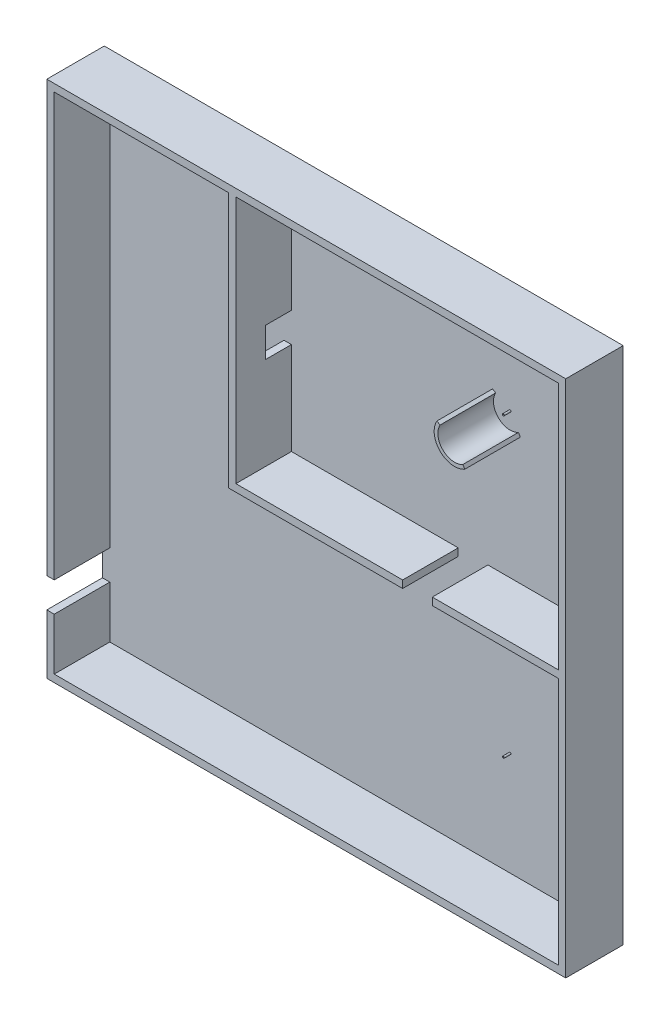
ISO-10303-21;
HEADER;
FILE_DESCRIPTION(('STEP AP214'),'2;1');
FILE_NAME('part.step','',(''),(''),'','','');
FILE_SCHEMA(('AUTOMOTIVE_DESIGN { 1 0 10303 214 1 1 1 1 }'));
ENDSEC;
DATA;
#1=APPLICATION_CONTEXT('core data for automotive mechanical design processes');
#2=APPLICATION_PROTOCOL_DEFINITION('international standard','automotive_design',2000,#1);
#3=PRODUCT_CONTEXT('',#1,'mechanical');
#4=PRODUCT('Part','Part','',(#3));
#5=PRODUCT_RELATED_PRODUCT_CATEGORY('part','',(#4));
#6=PRODUCT_DEFINITION_FORMATION('','',#4);
#7=PRODUCT_DEFINITION_CONTEXT('part definition',#1,'design');
#8=PRODUCT_DEFINITION('design','',#6,#7);
#9=PRODUCT_DEFINITION_SHAPE('','',#8);
#10=(LENGTH_UNIT() NAMED_UNIT(*) SI_UNIT(.MILLI.,.METRE.));
#11=(NAMED_UNIT(*) PLANE_ANGLE_UNIT() SI_UNIT($,.RADIAN.));
#12=(NAMED_UNIT(*) SI_UNIT($,.STERADIAN.) SOLID_ANGLE_UNIT());
#13=UNCERTAINTY_MEASURE_WITH_UNIT(LENGTH_MEASURE(1.E-05),#10,'distance_accuracy_value','');
#14=(GEOMETRIC_REPRESENTATION_CONTEXT(3) GLOBAL_UNCERTAINTY_ASSIGNED_CONTEXT((#13)) GLOBAL_UNIT_ASSIGNED_CONTEXT((#10,
#11,#12)) REPRESENTATION_CONTEXT('',''));
#15=CARTESIAN_POINT('',(0.,0.,0.));
#16=DIRECTION('',(0.,0.,1.));
#17=DIRECTION('',(1.,0.,0.));
#18=AXIS2_PLACEMENT_3D('',#15,#16,#17);
#19=CARTESIAN_POINT('',(4000.,4000.,1500.));
#20=DIRECTION('',(0.,0.,-1.));
#21=DIRECTION('',(-1.,0.,0.));
#22=AXIS2_PLACEMENT_3D('',#19,#20,#21);
#23=CYLINDRICAL_SURFACE('',#22,25.0000000000005);
#24=CARTESIAN_POINT('',(4000.,4000.,0.));
#25=DIRECTION('',(0.,0.,1.));
#26=DIRECTION('',(1.,0.,0.));
#27=AXIS2_PLACEMENT_3D('',#24,#25,#26);
#28=CIRCLE('',#27,25.0000000000005);
#29=CARTESIAN_POINT('',(4025.,4000.,0.));
#30=VERTEX_POINT('',#29);
#31=EDGE_CURVE('E552',#30,#30,#28,.T.);
#32=ORIENTED_EDGE('',*,*,#31,.T.);
#33=EDGE_LOOP('',(#32));
#34=FACE_BOUND('',#33,.T.);
#35=CARTESIAN_POINT('',(4000.,4000.,183.416876048224));
#36=DIRECTION('',(0.,0.,1.));
#37=DIRECTION('',(1.,0.,0.));
#38=AXIS2_PLACEMENT_3D('',#35,#36,#37);
#39=CIRCLE('',#38,25.0000000000005);
#40=CARTESIAN_POINT('',(4025.,4000.,183.416876048224));
#41=VERTEX_POINT('',#40);
#42=EDGE_CURVE('E498',#41,#41,#39,.T.);
#43=ORIENTED_EDGE('',*,*,#42,.F.);
#44=EDGE_LOOP('',(#43));
#45=FACE_BOUND('',#44,.T.);
#46=ADVANCED_FACE('F39',(#34,#45),#23,.T.);
#47=CARTESIAN_POINT('',(4000.,-4000.,1500.));
#48=DIRECTION('',(0.,0.,-1.));
#49=DIRECTION('',(-1.,0.,0.));
#50=AXIS2_PLACEMENT_3D('',#47,#48,#49);
#51=CYLINDRICAL_SURFACE('',#50,25.0000000000005);
#52=CARTESIAN_POINT('',(4000.,-4000.,0.));
#53=DIRECTION('',(0.,0.,1.));
#54=DIRECTION('',(1.,0.,0.));
#55=AXIS2_PLACEMENT_3D('',#52,#53,#54);
#56=CIRCLE('',#55,25.0000000000005);
#57=CARTESIAN_POINT('',(4025.,-4000.,0.));
#58=VERTEX_POINT('',#57);
#59=EDGE_CURVE('E556',#58,#58,#56,.T.);
#60=ORIENTED_EDGE('',*,*,#59,.T.);
#61=EDGE_LOOP('',(#60));
#62=FACE_BOUND('',#61,.T.);
#63=CARTESIAN_POINT('',(4000.,-4000.,183.416876048224));
#64=DIRECTION('',(0.,0.,1.));
#65=DIRECTION('',(1.,0.,0.));
#66=AXIS2_PLACEMENT_3D('',#63,#64,#65);
#67=CIRCLE('',#66,25.0000000000005);
#68=CARTESIAN_POINT('',(4025.,-4000.,183.416876048224));
#69=VERTEX_POINT('',#68);
#70=EDGE_CURVE('E497',#69,#69,#67,.T.);
#71=ORIENTED_EDGE('',*,*,#70,.F.);
#72=EDGE_LOOP('',(#71));
#73=FACE_BOUND('',#72,.T.);
#74=ADVANCED_FACE('F688',(#62,#73),#51,.T.);
#75=CARTESIAN_POINT('',(0.,0.,0.));
#76=DIRECTION('',(0.,0.,1.));
#77=DIRECTION('',(1.,0.,0.));
#78=AXIS2_PLACEMENT_3D('',#75,#76,#77);
#79=PLANE('',#78);
#80=ORIENTED_EDGE('',*,*,#31,.F.);
#81=EDGE_LOOP('',(#80));
#82=FACE_BOUND('',#81,.T.);
#83=ORIENTED_EDGE('',*,*,#59,.F.);
#84=EDGE_LOOP('',(#83));
#85=FACE_BOUND('',#84,.T.);
#86=DIRECTION('',(-1.,0.,0.));
#87=VECTOR('',#86,1.);
#88=CARTESIAN_POINT('',(-7000.,-5400.,0.));
#89=LINE('',#88,#87);
#90=CARTESIAN_POINT('',(-6800.,-5400.,0.));
#91=VERTEX_POINT('',#90);
#92=CARTESIAN_POINT('',(-7000.,-5400.,0.));
#93=VERTEX_POINT('',#92);
#94=EDGE_CURVE('E283',#91,#93,#89,.T.);
#95=ORIENTED_EDGE('',*,*,#94,.F.);
#96=DIRECTION('',(0.,1.,0.));
#97=VECTOR('',#96,1.);
#98=CARTESIAN_POINT('',(-6800.,-5400.,0.));
#99=LINE('',#98,#97);
#100=CARTESIAN_POINT('',(-6800.,-6800.,0.));
#101=VERTEX_POINT('',#100);
#102=EDGE_CURVE('E393',#101,#91,#99,.T.);
#103=ORIENTED_EDGE('',*,*,#102,.F.);
#104=DIRECTION('',(-1.,0.,0.));
#105=VECTOR('',#104,1.);
#106=CARTESIAN_POINT('',(-6800.,-6800.,0.));
#107=LINE('',#106,#105);
#108=CARTESIAN_POINT('',(6800.,-6800.,0.));
#109=VERTEX_POINT('',#108);
#110=EDGE_CURVE('E389',#109,#101,#107,.T.);
#111=ORIENTED_EDGE('',*,*,#110,.F.);
#112=DIRECTION('',(0.,-1.,0.));
#113=VECTOR('',#112,1.);
#114=CARTESIAN_POINT('',(6800.,-6800.,0.));
#115=LINE('',#114,#113);
#116=CARTESIAN_POINT('',(6800.,-99.9999999999992,0.));
#117=VERTEX_POINT('',#116);
#118=EDGE_CURVE('E385',#117,#109,#115,.T.);
#119=ORIENTED_EDGE('',*,*,#118,.F.);
#120=DIRECTION('',(1.,0.,0.));
#121=VECTOR('',#120,1.);
#122=CARTESIAN_POINT('',(6800.,-99.9999999999992,0.));
#123=LINE('',#122,#121);
#124=CARTESIAN_POINT('',(3400.,-99.9999999999996,0.));
#125=VERTEX_POINT('',#124);
#126=EDGE_CURVE('E381',#125,#117,#123,.T.);
#127=ORIENTED_EDGE('',*,*,#126,.F.);
#128=DIRECTION('',(0.,-1.,0.));
#129=VECTOR('',#128,1.);
#130=CARTESIAN_POINT('',(3400.,-99.9999999999996,0.));
#131=LINE('',#130,#129);
#132=CARTESIAN_POINT('',(3400.,100.,0.));
#133=VERTEX_POINT('',#132);
#134=EDGE_CURVE('E377',#133,#125,#131,.T.);
#135=ORIENTED_EDGE('',*,*,#134,.F.);
#136=DIRECTION('',(-1.,0.,0.));
#137=VECTOR('',#136,1.);
#138=CARTESIAN_POINT('',(3400.,100.,0.));
#139=LINE('',#138,#137);
#140=CARTESIAN_POINT('',(6800.,100.,0.));
#141=VERTEX_POINT('',#140);
#142=EDGE_CURVE('E373',#141,#133,#139,.T.);
#143=ORIENTED_EDGE('',*,*,#142,.F.);
#144=DIRECTION('',(0.,-1.,0.));
#145=VECTOR('',#144,1.);
#146=CARTESIAN_POINT('',(6800.,100.,0.));
#147=LINE('',#146,#145);
#148=CARTESIAN_POINT('',(6800.,6800.,0.));
#149=VERTEX_POINT('',#148);
#150=EDGE_CURVE('E369',#149,#141,#147,.T.);
#151=ORIENTED_EDGE('',*,*,#150,.F.);
#152=DIRECTION('',(1.,0.,0.));
#153=VECTOR('',#152,1.);
#154=CARTESIAN_POINT('',(6800.,6800.,0.));
#155=LINE('',#154,#153);
#156=CARTESIAN_POINT('',(-1900.,6800.,0.));
#157=VERTEX_POINT('',#156);
#158=EDGE_CURVE('E365',#157,#149,#155,.T.);
#159=ORIENTED_EDGE('',*,*,#158,.F.);
#160=DIRECTION('',(0.,1.,0.));
#161=VECTOR('',#160,1.);
#162=CARTESIAN_POINT('',(-1900.,6800.,0.));
#163=LINE('',#162,#161);
#164=CARTESIAN_POINT('',(-1900.,3400.,0.));
#165=VERTEX_POINT('',#164);
#166=EDGE_CURVE('E361',#165,#157,#163,.T.);
#167=ORIENTED_EDGE('',*,*,#166,.F.);
#168=DIRECTION('',(1.,0.,0.));
#169=VECTOR('',#168,1.);
#170=CARTESIAN_POINT('',(-1900.,3400.,0.));
#171=LINE('',#170,#169);
#172=CARTESIAN_POINT('',(-2100.,3400.,0.));
#173=VERTEX_POINT('',#172);
#174=EDGE_CURVE('E357',#173,#165,#171,.T.);
#175=ORIENTED_EDGE('',*,*,#174,.F.);
#176=DIRECTION('',(0.,-1.,0.));
#177=VECTOR('',#176,1.);
#178=CARTESIAN_POINT('',(-2100.,3400.,0.));
#179=LINE('',#178,#177);
#180=CARTESIAN_POINT('',(-2100.,6800.,0.));
#181=VERTEX_POINT('',#180);
#182=EDGE_CURVE('E353',#181,#173,#179,.T.);
#183=ORIENTED_EDGE('',*,*,#182,.F.);
#184=DIRECTION('',(1.,0.,0.));
#185=VECTOR('',#184,1.);
#186=CARTESIAN_POINT('',(-2100.,6800.,0.));
#187=LINE('',#186,#185);
#188=CARTESIAN_POINT('',(-6800.,6800.,0.));
#189=VERTEX_POINT('',#188);
#190=EDGE_CURVE('E349',#189,#181,#187,.T.);
#191=ORIENTED_EDGE('',*,*,#190,.F.);
#192=DIRECTION('',(0.,1.,0.));
#193=VECTOR('',#192,1.);
#194=CARTESIAN_POINT('',(-6800.,6800.,0.));
#195=LINE('',#194,#193);
#196=CARTESIAN_POINT('',(-6800.,-4600.,0.));
#197=VERTEX_POINT('',#196);
#198=EDGE_CURVE('E345',#197,#189,#195,.T.);
#199=ORIENTED_EDGE('',*,*,#198,.F.);
#200=DIRECTION('',(1.,0.,0.));
#201=VECTOR('',#200,1.);
#202=CARTESIAN_POINT('',(-6800.,-4600.,0.));
#203=LINE('',#202,#201);
#204=CARTESIAN_POINT('',(-7000.,-4600.,0.));
#205=VERTEX_POINT('',#204);
#206=EDGE_CURVE('E272',#205,#197,#203,.T.);
#207=ORIENTED_EDGE('',*,*,#206,.F.);
#208=DIRECTION('',(0.,-1.,0.));
#209=VECTOR('',#208,1.);
#210=CARTESIAN_POINT('',(-7000.,7000.,0.));
#211=LINE('',#210,#209);
#212=EDGE_CURVE('E461',#205,#93,#211,.T.);
#213=ORIENTED_EDGE('',*,*,#212,.T.);
#214=EDGE_LOOP('',(#95,#103,#111,#119,#127,#135,#143,#151,#159,#167,#175,#183,#191,#199,#207,#213));
#215=FACE_BOUND('',#214,.T.);
#216=DIRECTION('',(0.,1.,0.));
#217=VECTOR('',#216,1.);
#218=CARTESIAN_POINT('',(-1900.,2600.,0.));
#219=LINE('',#218,#217);
#220=CARTESIAN_POINT('',(-1900.,100.,0.));
#221=VERTEX_POINT('',#220);
#222=CARTESIAN_POINT('',(-1900.,2600.,0.));
#223=VERTEX_POINT('',#222);
#224=EDGE_CURVE('E265',#221,#223,#219,.T.);
#225=ORIENTED_EDGE('',*,*,#224,.F.);
#226=DIRECTION('',(-1.,0.,0.));
#227=VECTOR('',#226,1.);
#228=CARTESIAN_POINT('',(-1900.,100.,0.));
#229=LINE('',#228,#227);
#230=CARTESIAN_POINT('',(2600.,100.,0.));
#231=VERTEX_POINT('',#230);
#232=EDGE_CURVE('E560',#231,#221,#229,.T.);
#233=ORIENTED_EDGE('',*,*,#232,.F.);
#234=DIRECTION('',(0.,1.,0.));
#235=VECTOR('',#234,1.);
#236=CARTESIAN_POINT('',(2600.,100.,0.));
#237=LINE('',#236,#235);
#238=CARTESIAN_POINT('',(2600.,-99.9999999999996,0.));
#239=VERTEX_POINT('',#238);
#240=EDGE_CURVE('E566',#239,#231,#237,.T.);
#241=ORIENTED_EDGE('',*,*,#240,.F.);
#242=DIRECTION('',(1.,0.,0.));
#243=VECTOR('',#242,1.);
#244=CARTESIAN_POINT('',(2600.,-99.9999999999996,0.));
#245=LINE('',#244,#243);
#246=CARTESIAN_POINT('',(-2100.,-100.,0.));
#247=VERTEX_POINT('',#246);
#248=EDGE_CURVE('E584',#247,#239,#245,.T.);
#249=ORIENTED_EDGE('',*,*,#248,.F.);
#250=DIRECTION('',(0.,-1.,0.));
#251=VECTOR('',#250,1.);
#252=CARTESIAN_POINT('',(-2100.,-100.,0.));
#253=LINE('',#252,#251);
#254=CARTESIAN_POINT('',(-2100.,2600.,0.));
#255=VERTEX_POINT('',#254);
#256=EDGE_CURVE('E581',#255,#247,#253,.T.);
#257=ORIENTED_EDGE('',*,*,#256,.F.);
#258=DIRECTION('',(-1.,0.,0.));
#259=VECTOR('',#258,1.);
#260=CARTESIAN_POINT('',(-2100.,2600.,0.));
#261=LINE('',#260,#259);
#262=EDGE_CURVE('E578',#223,#255,#261,.T.);
#263=ORIENTED_EDGE('',*,*,#262,.F.);
#264=EDGE_LOOP('',(#225,#233,#241,#249,#257,#263));
#265=FACE_BOUND('',#264,.T.);
#266=DIRECTION('',(-0.49999999999999,0.866025403784444,0.));
#267=VECTOR('',#266,1.);
#268=CARTESIAN_POINT('',(4275.,3523.68602791856,0.));
#269=LINE('',#268,#267);
#270=CARTESIAN_POINT('',(4275.,3523.68602791856,0.));
#271=VERTEX_POINT('',#270);
#272=CARTESIAN_POINT('',(4225.,3610.288568297,0.));
#273=VERTEX_POINT('',#272);
#274=EDGE_CURVE('E532',#271,#273,#269,.T.);
#275=ORIENTED_EDGE('',*,*,#274,.F.);
#276=CARTESIAN_POINT('',(4000.,4000.,0.));
#277=DIRECTION('',(0.,0.,1.));
#278=DIRECTION('',(1.,0.,0.));
#279=AXIS2_PLACEMENT_3D('',#276,#277,#278);
#280=CIRCLE('',#279,550.);
#281=CARTESIAN_POINT('',(3523.68602791856,4275.,0.));
#282=VERTEX_POINT('',#281);
#283=EDGE_CURVE('E504',#282,#271,#280,.T.);
#284=ORIENTED_EDGE('',*,*,#283,.F.);
#285=DIRECTION('',(-0.86602540378444,0.499999999999997,0.));
#286=VECTOR('',#285,1.);
#287=CARTESIAN_POINT('',(3523.68602791856,4275.,0.));
#288=LINE('',#287,#286);
#289=CARTESIAN_POINT('',(3610.288568297,4225.,0.));
#290=VERTEX_POINT('',#289);
#291=EDGE_CURVE('E519',#290,#282,#288,.T.);
#292=ORIENTED_EDGE('',*,*,#291,.F.);
#293=CARTESIAN_POINT('',(4000.,4000.,0.));
#294=DIRECTION('',(0.,0.,-1.));
#295=DIRECTION('',(1.,0.,0.));
#296=AXIS2_PLACEMENT_3D('',#293,#294,#295);
#297=CIRCLE('',#296,450.);
#298=EDGE_CURVE('E535',#273,#290,#297,.T.);
#299=ORIENTED_EDGE('',*,*,#298,.F.);
#300=EDGE_LOOP('',(#275,#284,#292,#299));
#301=FACE_BOUND('',#300,.T.);
#302=ADVANCED_FACE('F605',(#82,#85,#215,#265,#301),#79,.T.);
#303=CARTESIAN_POINT('',(7000.,7000.,-50.));
#304=DIRECTION('',(1.,0.,0.));
#305=DIRECTION('',(0.,1.,0.));
#306=AXIS2_PLACEMENT_3D('',#303,#304,#305);
#307=PLANE('',#306);
#308=DIRECTION('',(0.,0.,1.));
#309=VECTOR('',#308,1.);
#310=CARTESIAN_POINT('',(7000.,7000.,-50.));
#311=LINE('',#310,#309);
#312=CARTESIAN_POINT('',(7000.,7000.,-50.));
#313=VERTEX_POINT('',#312);
#314=CARTESIAN_POINT('',(7000.,7000.,1500.));
#315=VERTEX_POINT('',#314);
#316=EDGE_CURVE('E478',#313,#315,#311,.T.);
#317=ORIENTED_EDGE('',*,*,#316,.T.);
#318=DIRECTION('',(0.,1.,0.));
#319=VECTOR('',#318,1.);
#320=CARTESIAN_POINT('',(7000.,7000.,1500.));
#321=LINE('',#320,#319);
#322=CARTESIAN_POINT('',(7000.,-7000.,1500.));
#323=VERTEX_POINT('',#322);
#324=EDGE_CURVE('E333',#323,#315,#321,.T.);
#325=ORIENTED_EDGE('',*,*,#324,.F.);
#326=DIRECTION('',(0.,0.,1.));
#327=VECTOR('',#326,1.);
#328=CARTESIAN_POINT('',(7000.,-7000.,-50.));
#329=LINE('',#328,#327);
#330=CARTESIAN_POINT('',(7000.,-7000.,-50.));
#331=VERTEX_POINT('',#330);
#332=EDGE_CURVE('E481',#331,#323,#329,.T.);
#333=ORIENTED_EDGE('',*,*,#332,.F.);
#334=DIRECTION('',(0.,1.,0.));
#335=VECTOR('',#334,1.);
#336=CARTESIAN_POINT('',(7000.,7000.,-50.));
#337=LINE('',#336,#335);
#338=EDGE_CURVE('E462',#331,#313,#337,.T.);
#339=ORIENTED_EDGE('',*,*,#338,.T.);
#340=EDGE_LOOP('',(#317,#325,#333,#339));
#341=FACE_BOUND('',#340,.T.);
#342=ADVANCED_FACE('F41',(#341),#307,.T.);
#343=CARTESIAN_POINT('',(-7000.,-7000.,-50.));
#344=DIRECTION('',(0.,-1.,0.));
#345=DIRECTION('',(0.,0.,-1.));
#346=AXIS2_PLACEMENT_3D('',#343,#344,#345);
#347=PLANE('',#346);
#348=ORIENTED_EDGE('',*,*,#332,.T.);
#349=DIRECTION('',(1.,0.,0.));
#350=VECTOR('',#349,1.);
#351=CARTESIAN_POINT('',(7000.,-7000.,1500.));
#352=LINE('',#351,#350);
#353=CARTESIAN_POINT('',(-7000.,-7000.,1500.));
#354=VERTEX_POINT('',#353);
#355=EDGE_CURVE('E329',#354,#323,#352,.T.);
#356=ORIENTED_EDGE('',*,*,#355,.F.);
#357=DIRECTION('',(0.,0.,1.));
#358=VECTOR('',#357,1.);
#359=CARTESIAN_POINT('',(-7000.,-7000.,-50.));
#360=LINE('',#359,#358);
#361=CARTESIAN_POINT('',(-7000.,-7000.,-50.));
#362=VERTEX_POINT('',#361);
#363=EDGE_CURVE('E484',#362,#354,#360,.T.);
#364=ORIENTED_EDGE('',*,*,#363,.F.);
#365=DIRECTION('',(1.,0.,0.));
#366=VECTOR('',#365,1.);
#367=CARTESIAN_POINT('',(-7000.,-7000.,-50.));
#368=LINE('',#367,#366);
#369=EDGE_CURVE('E474',#362,#331,#368,.T.);
#370=ORIENTED_EDGE('',*,*,#369,.T.);
#371=EDGE_LOOP('',(#348,#356,#364,#370));
#372=FACE_BOUND('',#371,.T.);
#373=ADVANCED_FACE('F979',(#372),#347,.T.);
#374=CARTESIAN_POINT('',(-7000.,7000.,-50.));
#375=DIRECTION('',(-1.,0.,0.));
#376=DIRECTION('',(0.,-1.,0.));
#377=AXIS2_PLACEMENT_3D('',#374,#375,#376);
#378=PLANE('',#377);
#379=ORIENTED_EDGE('',*,*,#212,.F.);
#380=DIRECTION('',(0.,0.,-1.));
#381=VECTOR('',#380,1.);
#382=CARTESIAN_POINT('',(-7000.,-4600.,1500.));
#383=LINE('',#382,#381);
#384=CARTESIAN_POINT('',(-7000.,-4600.,1500.));
#385=VERTEX_POINT('',#384);
#386=EDGE_CURVE('E457',#385,#205,#383,.T.);
#387=ORIENTED_EDGE('',*,*,#386,.F.);
#388=DIRECTION('',(0.,-1.,0.));
#389=VECTOR('',#388,1.);
#390=CARTESIAN_POINT('',(-7000.,-4600.,1500.));
#391=LINE('',#390,#389);
#392=CARTESIAN_POINT('',(-7000.,7000.,1500.));
#393=VERTEX_POINT('',#392);
#394=EDGE_CURVE('E278',#393,#385,#391,.T.);
#395=ORIENTED_EDGE('',*,*,#394,.F.);
#396=DIRECTION('',(0.,0.,1.));
#397=VECTOR('',#396,1.);
#398=CARTESIAN_POINT('',(-7000.,7000.,-50.));
#399=LINE('',#398,#397);
#400=CARTESIAN_POINT('',(-7000.,7000.,-50.));
#401=VERTEX_POINT('',#400);
#402=EDGE_CURVE('E487',#401,#393,#399,.T.);
#403=ORIENTED_EDGE('',*,*,#402,.F.);
#404=DIRECTION('',(0.,-1.,0.));
#405=VECTOR('',#404,1.);
#406=CARTESIAN_POINT('',(-7000.,7000.,-50.));
#407=LINE('',#406,#405);
#408=EDGE_CURVE('E470',#401,#362,#407,.T.);
#409=ORIENTED_EDGE('',*,*,#408,.T.);
#410=ORIENTED_EDGE('',*,*,#363,.T.);
#411=DIRECTION('',(0.,-1.,0.));
#412=VECTOR('',#411,1.);
#413=CARTESIAN_POINT('',(-7000.,-7000.,1500.));
#414=LINE('',#413,#412);
#415=CARTESIAN_POINT('',(-7000.,-5400.,1500.));
#416=VERTEX_POINT('',#415);
#417=EDGE_CURVE('E325',#416,#354,#414,.T.);
#418=ORIENTED_EDGE('',*,*,#417,.F.);
#419=DIRECTION('',(0.,0.,-1.));
#420=VECTOR('',#419,1.);
#421=CARTESIAN_POINT('',(-7000.,-5400.,1500.));
#422=LINE('',#421,#420);
#423=EDGE_CURVE('E341',#416,#93,#422,.T.);
#424=ORIENTED_EDGE('',*,*,#423,.T.);
#425=EDGE_LOOP('',(#379,#387,#395,#403,#409,#410,#418,#424));
#426=FACE_BOUND('',#425,.T.);
#427=ADVANCED_FACE('F634',(#426),#378,.T.);
#428=CARTESIAN_POINT('',(-7000.,7000.,-50.));
#429=DIRECTION('',(0.,1.,0.));
#430=DIRECTION('',(0.,0.,1.));
#431=AXIS2_PLACEMENT_3D('',#428,#429,#430);
#432=PLANE('',#431);
#433=ORIENTED_EDGE('',*,*,#402,.T.);
#434=DIRECTION('',(-1.,0.,0.));
#435=VECTOR('',#434,1.);
#436=CARTESIAN_POINT('',(-7000.,7000.,1500.));
#437=LINE('',#436,#435);
#438=EDGE_CURVE('E337',#315,#393,#437,.T.);
#439=ORIENTED_EDGE('',*,*,#438,.F.);
#440=ORIENTED_EDGE('',*,*,#316,.F.);
#441=DIRECTION('',(-1.,0.,0.));
#442=VECTOR('',#441,1.);
#443=CARTESIAN_POINT('',(-7000.,7000.,-50.));
#444=LINE('',#443,#442);
#445=EDGE_CURVE('E466',#313,#401,#444,.T.);
#446=ORIENTED_EDGE('',*,*,#445,.T.);
#447=EDGE_LOOP('',(#433,#439,#440,#446));
#448=FACE_BOUND('',#447,.T.);
#449=ADVANCED_FACE('F993',(#448),#432,.T.);
#450=CARTESIAN_POINT('',(0.,0.,-50.));
#451=DIRECTION('',(0.,0.,1.));
#452=DIRECTION('',(1.,0.,0.));
#453=AXIS2_PLACEMENT_3D('',#450,#451,#452);
#454=PLANE('',#453);
#455=ORIENTED_EDGE('',*,*,#338,.F.);
#456=ORIENTED_EDGE('',*,*,#369,.F.);
#457=ORIENTED_EDGE('',*,*,#408,.F.);
#458=ORIENTED_EDGE('',*,*,#445,.F.);
#459=EDGE_LOOP('',(#455,#456,#457,#458));
#460=FACE_BOUND('',#459,.T.);
#461=ADVANCED_FACE('F1000',(#460),#454,.F.);
#462=CARTESIAN_POINT('',(-6800.,-4600.,1500.));
#463=DIRECTION('',(0.,1.,0.));
#464=DIRECTION('',(-1.,0.,0.));
#465=AXIS2_PLACEMENT_3D('',#462,#463,#464);
#466=PLANE('',#465);
#467=ORIENTED_EDGE('',*,*,#206,.T.);
#468=DIRECTION('',(0.,0.,-1.));
#469=VECTOR('',#468,1.);
#470=CARTESIAN_POINT('',(-6800.,-4600.,1500.));
#471=LINE('',#470,#469);
#472=CARTESIAN_POINT('',(-6800.,-4600.,1500.));
#473=VERTEX_POINT('',#472);
#474=EDGE_CURVE('E453',#473,#197,#471,.T.);
#475=ORIENTED_EDGE('',*,*,#474,.F.);
#476=DIRECTION('',(1.,0.,0.));
#477=VECTOR('',#476,1.);
#478=CARTESIAN_POINT('',(-6800.,-4600.,1500.));
#479=LINE('',#478,#477);
#480=EDGE_CURVE('E282',#385,#473,#479,.T.);
#481=ORIENTED_EDGE('',*,*,#480,.F.);
#482=ORIENTED_EDGE('',*,*,#386,.T.);
#483=EDGE_LOOP('',(#467,#475,#481,#482));
#484=FACE_BOUND('',#483,.T.);
#485=ADVANCED_FACE('F630',(#484),#466,.F.);
#486=CARTESIAN_POINT('',(-6800.,6800.,1500.));
#487=DIRECTION('',(-1.,0.,0.));
#488=DIRECTION('',(0.,-1.,0.));
#489=AXIS2_PLACEMENT_3D('',#486,#487,#488);
#490=PLANE('',#489);
#491=ORIENTED_EDGE('',*,*,#198,.T.);
#492=DIRECTION('',(0.,0.,-1.));
#493=VECTOR('',#492,1.);
#494=CARTESIAN_POINT('',(-6800.,6800.,1500.));
#495=LINE('',#494,#493);
#496=CARTESIAN_POINT('',(-6800.,6800.,1500.));
#497=VERTEX_POINT('',#496);
#498=EDGE_CURVE('E449',#497,#189,#495,.T.);
#499=ORIENTED_EDGE('',*,*,#498,.F.);
#500=DIRECTION('',(0.,1.,0.));
#501=VECTOR('',#500,1.);
#502=CARTESIAN_POINT('',(-6800.,6800.,1500.));
#503=LINE('',#502,#501);
#504=EDGE_CURVE('E286',#473,#497,#503,.T.);
#505=ORIENTED_EDGE('',*,*,#504,.F.);
#506=ORIENTED_EDGE('',*,*,#474,.T.);
#507=EDGE_LOOP('',(#491,#499,#505,#506));
#508=FACE_BOUND('',#507,.T.);
#509=ADVANCED_FACE('F626',(#508),#490,.F.);
#510=CARTESIAN_POINT('',(-2100.,6800.,1500.));
#511=DIRECTION('',(0.,1.,0.));
#512=DIRECTION('',(-1.,0.,0.));
#513=AXIS2_PLACEMENT_3D('',#510,#511,#512);
#514=PLANE('',#513);
#515=ORIENTED_EDGE('',*,*,#190,.T.);
#516=DIRECTION('',(0.,0.,-1.));
#517=VECTOR('',#516,1.);
#518=CARTESIAN_POINT('',(-2100.,6800.,1500.));
#519=LINE('',#518,#517);
#520=CARTESIAN_POINT('',(-2100.,6800.,1500.));
#521=VERTEX_POINT('',#520);
#522=EDGE_CURVE('E445',#521,#181,#519,.T.);
#523=ORIENTED_EDGE('',*,*,#522,.F.);
#524=DIRECTION('',(1.,0.,0.));
#525=VECTOR('',#524,1.);
#526=CARTESIAN_POINT('',(-2100.,6800.,1500.));
#527=LINE('',#526,#525);
#528=EDGE_CURVE('E289',#497,#521,#527,.T.);
#529=ORIENTED_EDGE('',*,*,#528,.F.);
#530=ORIENTED_EDGE('',*,*,#498,.T.);
#531=EDGE_LOOP('',(#515,#523,#529,#530));
#532=FACE_BOUND('',#531,.T.);
#533=ADVANCED_FACE('F621',(#532),#514,.F.);
#534=CARTESIAN_POINT('',(-2100.,3400.,1500.));
#535=DIRECTION('',(1.,0.,0.));
#536=DIRECTION('',(0.,0.,-1.));
#537=AXIS2_PLACEMENT_3D('',#534,#535,#536);
#538=PLANE('',#537);
#539=DIRECTION('',(0.,0.,-1.));
#540=VECTOR('',#539,1.);
#541=CARTESIAN_POINT('',(-2100.,-100.,1500.));
#542=LINE('',#541,#540);
#543=CARTESIAN_POINT('',(-2100.,-100.,1500.));
#544=VERTEX_POINT('',#543);
#545=EDGE_CURVE('E274',#544,#247,#542,.T.);
#546=ORIENTED_EDGE('',*,*,#545,.F.);
#547=DIRECTION('',(0.,-1.,0.));
#548=VECTOR('',#547,1.);
#549=CARTESIAN_POINT('',(-2100.,3400.,1500.));
#550=LINE('',#549,#548);
#551=EDGE_CURVE('E292',#521,#544,#550,.T.);
#552=ORIENTED_EDGE('',*,*,#551,.F.);
#553=ORIENTED_EDGE('',*,*,#522,.T.);
#554=ORIENTED_EDGE('',*,*,#182,.T.);
#555=DIRECTION('',(0.,0.,-1.));
#556=VECTOR('',#555,1.);
#557=CARTESIAN_POINT('',(-2100.,3400.,1500.));
#558=LINE('',#557,#556);
#559=CARTESIAN_POINT('',(-2100.,3400.,700.));
#560=VERTEX_POINT('',#559);
#561=EDGE_CURVE('E442',#560,#173,#558,.T.);
#562=ORIENTED_EDGE('',*,*,#561,.F.);
#563=DIRECTION('',(0.,-1.,0.));
#564=VECTOR('',#563,1.);
#565=CARTESIAN_POINT('',(-2100.,2152.28992603385,700.));
#566=LINE('',#565,#564);
#567=CARTESIAN_POINT('',(-2100.,2600.,700.));
#568=VERTEX_POINT('',#567);
#569=EDGE_CURVE('E251',#560,#568,#566,.T.);
#570=ORIENTED_EDGE('',*,*,#569,.T.);
#571=DIRECTION('',(0.,0.,-1.));
#572=VECTOR('',#571,1.);
#573=CARTESIAN_POINT('',(-2100.,2600.,1500.));
#574=LINE('',#573,#572);
#575=EDGE_CURVE('E259',#568,#255,#574,.T.);
#576=ORIENTED_EDGE('',*,*,#575,.T.);
#577=ORIENTED_EDGE('',*,*,#256,.T.);
#578=EDGE_LOOP('',(#546,#552,#553,#554,#562,#570,#576,#577));
#579=FACE_BOUND('',#578,.T.);
#580=ADVANCED_FACE('F618',(#579),#538,.F.);
#581=CARTESIAN_POINT('',(-1900.,3400.,1500.));
#582=DIRECTION('',(0.,1.,0.));
#583=DIRECTION('',(0.,0.,1.));
#584=AXIS2_PLACEMENT_3D('',#581,#582,#583);
#585=PLANE('',#584);
#586=DIRECTION('',(0.,0.,-1.));
#587=VECTOR('',#586,1.);
#588=CARTESIAN_POINT('',(-1900.,3400.,1500.));
#589=LINE('',#588,#587);
#590=CARTESIAN_POINT('',(-1900.,3400.,700.));
#591=VERTEX_POINT('',#590);
#592=EDGE_CURVE('E439',#591,#165,#589,.T.);
#593=ORIENTED_EDGE('',*,*,#592,.F.);
#594=DIRECTION('',(-1.,0.,0.));
#595=VECTOR('',#594,1.);
#596=CARTESIAN_POINT('',(-1900.,3400.,700.));
#597=LINE('',#596,#595);
#598=EDGE_CURVE('E246',#591,#560,#597,.T.);
#599=ORIENTED_EDGE('',*,*,#598,.T.);
#600=ORIENTED_EDGE('',*,*,#561,.T.);
#601=ORIENTED_EDGE('',*,*,#174,.T.);
#602=EDGE_LOOP('',(#593,#599,#600,#601));
#603=FACE_BOUND('',#602,.T.);
#604=ADVANCED_FACE('F675',(#603),#585,.F.);
#605=CARTESIAN_POINT('',(-1900.,6800.,1500.));
#606=DIRECTION('',(-1.,0.,0.));
#607=DIRECTION('',(0.,-1.,0.));
#608=AXIS2_PLACEMENT_3D('',#605,#606,#607);
#609=PLANE('',#608);
#610=DIRECTION('',(0.,0.,-1.));
#611=VECTOR('',#610,1.);
#612=CARTESIAN_POINT('',(-1900.,6800.,1500.));
#613=LINE('',#612,#611);
#614=CARTESIAN_POINT('',(-1900.,6800.,1500.));
#615=VERTEX_POINT('',#614);
#616=EDGE_CURVE('E435',#615,#157,#613,.T.);
#617=ORIENTED_EDGE('',*,*,#616,.F.);
#618=DIRECTION('',(0.,1.,0.));
#619=VECTOR('',#618,1.);
#620=CARTESIAN_POINT('',(-1900.,6800.,1500.));
#621=LINE('',#620,#619);
#622=CARTESIAN_POINT('',(-1900.,100.,1500.));
#623=VERTEX_POINT('',#622);
#624=EDGE_CURVE('E295',#623,#615,#621,.T.);
#625=ORIENTED_EDGE('',*,*,#624,.F.);
#626=DIRECTION('',(0.,0.,-1.));
#627=VECTOR('',#626,1.);
#628=CARTESIAN_POINT('',(-1900.,100.,1500.));
#629=LINE('',#628,#627);
#630=EDGE_CURVE('E268',#623,#221,#629,.T.);
#631=ORIENTED_EDGE('',*,*,#630,.T.);
#632=ORIENTED_EDGE('',*,*,#224,.T.);
#633=DIRECTION('',(0.,0.,-1.));
#634=VECTOR('',#633,1.);
#635=CARTESIAN_POINT('',(-1900.,2600.,1500.));
#636=LINE('',#635,#634);
#637=CARTESIAN_POINT('',(-1900.,2600.,700.));
#638=VERTEX_POINT('',#637);
#639=EDGE_CURVE('E257',#638,#223,#636,.T.);
#640=ORIENTED_EDGE('',*,*,#639,.F.);
#641=DIRECTION('',(0.,1.,0.));
#642=VECTOR('',#641,1.);
#643=CARTESIAN_POINT('',(-1900.,3671.9436957082,700.));
#644=LINE('',#643,#642);
#645=EDGE_CURVE('E240',#638,#591,#644,.T.);
#646=ORIENTED_EDGE('',*,*,#645,.T.);
#647=ORIENTED_EDGE('',*,*,#592,.T.);
#648=ORIENTED_EDGE('',*,*,#166,.T.);
#649=EDGE_LOOP('',(#617,#625,#631,#632,#640,#646,#647,#648));
#650=FACE_BOUND('',#649,.T.);
#651=ADVANCED_FACE('F263',(#650),#609,.F.);
#652=CARTESIAN_POINT('',(6800.,6800.,1500.));
#653=DIRECTION('',(0.,1.,0.));
#654=DIRECTION('',(-1.,0.,0.));
#655=AXIS2_PLACEMENT_3D('',#652,#653,#654);
#656=PLANE('',#655);
#657=ORIENTED_EDGE('',*,*,#158,.T.);
#658=DIRECTION('',(0.,0.,-1.));
#659=VECTOR('',#658,1.);
#660=CARTESIAN_POINT('',(6800.,6800.,1500.));
#661=LINE('',#660,#659);
#662=CARTESIAN_POINT('',(6800.,6800.,1500.));
#663=VERTEX_POINT('',#662);
#664=EDGE_CURVE('E431',#663,#149,#661,.T.);
#665=ORIENTED_EDGE('',*,*,#664,.F.);
#666=DIRECTION('',(1.,0.,0.));
#667=VECTOR('',#666,1.);
#668=CARTESIAN_POINT('',(6800.,6800.,1500.));
#669=LINE('',#668,#667);
#670=EDGE_CURVE('E298',#615,#663,#669,.T.);
#671=ORIENTED_EDGE('',*,*,#670,.F.);
#672=ORIENTED_EDGE('',*,*,#616,.T.);
#673=EDGE_LOOP('',(#657,#665,#671,#672));
#674=FACE_BOUND('',#673,.T.);
#675=ADVANCED_FACE('F672',(#674),#656,.F.);
#676=CARTESIAN_POINT('',(6800.,100.,1500.));
#677=DIRECTION('',(1.,0.,0.));
#678=DIRECTION('',(0.,0.,-1.));
#679=AXIS2_PLACEMENT_3D('',#676,#677,#678);
#680=PLANE('',#679);
#681=ORIENTED_EDGE('',*,*,#150,.T.);
#682=DIRECTION('',(0.,0.,-1.));
#683=VECTOR('',#682,1.);
#684=CARTESIAN_POINT('',(6800.,100.,1500.));
#685=LINE('',#684,#683);
#686=CARTESIAN_POINT('',(6800.,100.,1500.));
#687=VERTEX_POINT('',#686);
#688=EDGE_CURVE('E427',#687,#141,#685,.T.);
#689=ORIENTED_EDGE('',*,*,#688,.F.);
#690=DIRECTION('',(0.,-1.,0.));
#691=VECTOR('',#690,1.);
#692=CARTESIAN_POINT('',(6800.,100.,1500.));
#693=LINE('',#692,#691);
#694=EDGE_CURVE('E301',#663,#687,#693,.T.);
#695=ORIENTED_EDGE('',*,*,#694,.F.);
#696=ORIENTED_EDGE('',*,*,#664,.T.);
#697=EDGE_LOOP('',(#681,#689,#695,#696));
#698=FACE_BOUND('',#697,.T.);
#699=ADVANCED_FACE('F667',(#698),#680,.F.);
#700=CARTESIAN_POINT('',(3400.,100.,1500.));
#701=DIRECTION('',(0.,-1.,0.));
#702=DIRECTION('',(0.,0.,-1.));
#703=AXIS2_PLACEMENT_3D('',#700,#701,#702);
#704=PLANE('',#703);
#705=ORIENTED_EDGE('',*,*,#142,.T.);
#706=DIRECTION('',(0.,0.,-1.));
#707=VECTOR('',#706,1.);
#708=CARTESIAN_POINT('',(3400.,100.,1500.));
#709=LINE('',#708,#707);
#710=CARTESIAN_POINT('',(3400.,100.,1500.));
#711=VERTEX_POINT('',#710);
#712=EDGE_CURVE('E423',#711,#133,#709,.T.);
#713=ORIENTED_EDGE('',*,*,#712,.F.);
#714=DIRECTION('',(-1.,0.,0.));
#715=VECTOR('',#714,1.);
#716=CARTESIAN_POINT('',(3400.,100.,1500.));
#717=LINE('',#716,#715);
#718=EDGE_CURVE('E304',#687,#711,#717,.T.);
#719=ORIENTED_EDGE('',*,*,#718,.F.);
#720=ORIENTED_EDGE('',*,*,#688,.T.);
#721=EDGE_LOOP('',(#705,#713,#719,#720));
#722=FACE_BOUND('',#721,.T.);
#723=ADVANCED_FACE('F664',(#722),#704,.F.);
#724=CARTESIAN_POINT('',(3400.,-99.9999999999996,1500.));
#725=DIRECTION('',(1.,0.,0.));
#726=DIRECTION('',(0.,0.,-1.));
#727=AXIS2_PLACEMENT_3D('',#724,#725,#726);
#728=PLANE('',#727);
#729=ORIENTED_EDGE('',*,*,#134,.T.);
#730=DIRECTION('',(0.,0.,-1.));
#731=VECTOR('',#730,1.);
#732=CARTESIAN_POINT('',(3400.,-99.9999999999996,1500.));
#733=LINE('',#732,#731);
#734=CARTESIAN_POINT('',(3400.,-99.9999999999996,1500.));
#735=VERTEX_POINT('',#734);
#736=EDGE_CURVE('E419',#735,#125,#733,.T.);
#737=ORIENTED_EDGE('',*,*,#736,.F.);
#738=DIRECTION('',(0.,-1.,0.));
#739=VECTOR('',#738,1.);
#740=CARTESIAN_POINT('',(3400.,-99.9999999999996,1500.));
#741=LINE('',#740,#739);
#742=EDGE_CURVE('E307',#711,#735,#741,.T.);
#743=ORIENTED_EDGE('',*,*,#742,.F.);
#744=ORIENTED_EDGE('',*,*,#712,.T.);
#745=EDGE_LOOP('',(#729,#737,#743,#744));
#746=FACE_BOUND('',#745,.T.);
#747=ADVANCED_FACE('F659',(#746),#728,.F.);
#748=CARTESIAN_POINT('',(6800.,-99.9999999999992,1500.));
#749=DIRECTION('',(0.,1.,0.));
#750=DIRECTION('',(-1.,0.,0.));
#751=AXIS2_PLACEMENT_3D('',#748,#749,#750);
#752=PLANE('',#751);
#753=ORIENTED_EDGE('',*,*,#126,.T.);
#754=DIRECTION('',(0.,0.,-1.));
#755=VECTOR('',#754,1.);
#756=CARTESIAN_POINT('',(6800.,-99.9999999999992,1500.));
#757=LINE('',#756,#755);
#758=CARTESIAN_POINT('',(6800.,-99.9999999999992,1500.));
#759=VERTEX_POINT('',#758);
#760=EDGE_CURVE('E415',#759,#117,#757,.T.);
#761=ORIENTED_EDGE('',*,*,#760,.F.);
#762=DIRECTION('',(1.,0.,0.));
#763=VECTOR('',#762,1.);
#764=CARTESIAN_POINT('',(6800.,-99.9999999999992,1500.));
#765=LINE('',#764,#763);
#766=EDGE_CURVE('E310',#735,#759,#765,.T.);
#767=ORIENTED_EDGE('',*,*,#766,.F.);
#768=ORIENTED_EDGE('',*,*,#736,.T.);
#769=EDGE_LOOP('',(#753,#761,#767,#768));
#770=FACE_BOUND('',#769,.T.);
#771=ADVANCED_FACE('F656',(#770),#752,.F.);
#772=CARTESIAN_POINT('',(6800.,-6800.,1500.));
#773=DIRECTION('',(1.,0.,0.));
#774=DIRECTION('',(0.,0.,-1.));
#775=AXIS2_PLACEMENT_3D('',#772,#773,#774);
#776=PLANE('',#775);
#777=ORIENTED_EDGE('',*,*,#118,.T.);
#778=DIRECTION('',(0.,0.,-1.));
#779=VECTOR('',#778,1.);
#780=CARTESIAN_POINT('',(6800.,-6800.,1500.));
#781=LINE('',#780,#779);
#782=CARTESIAN_POINT('',(6800.,-6800.,1500.));
#783=VERTEX_POINT('',#782);
#784=EDGE_CURVE('E411',#783,#109,#781,.T.);
#785=ORIENTED_EDGE('',*,*,#784,.F.);
#786=DIRECTION('',(0.,-1.,0.));
#787=VECTOR('',#786,1.);
#788=CARTESIAN_POINT('',(6800.,-6800.,1500.));
#789=LINE('',#788,#787);
#790=EDGE_CURVE('E313',#759,#783,#789,.T.);
#791=ORIENTED_EDGE('',*,*,#790,.F.);
#792=ORIENTED_EDGE('',*,*,#760,.T.);
#793=EDGE_LOOP('',(#777,#785,#791,#792));
#794=FACE_BOUND('',#793,.T.);
#795=ADVANCED_FACE('F651',(#794),#776,.F.);
#796=CARTESIAN_POINT('',(-6800.,-6800.,1500.));
#797=DIRECTION('',(0.,-1.,0.));
#798=DIRECTION('',(0.,0.,-1.));
#799=AXIS2_PLACEMENT_3D('',#796,#797,#798);
#800=PLANE('',#799);
#801=ORIENTED_EDGE('',*,*,#110,.T.);
#802=DIRECTION('',(0.,0.,-1.));
#803=VECTOR('',#802,1.);
#804=CARTESIAN_POINT('',(-6800.,-6800.,1500.));
#805=LINE('',#804,#803);
#806=CARTESIAN_POINT('',(-6800.,-6800.,1500.));
#807=VERTEX_POINT('',#806);
#808=EDGE_CURVE('E407',#807,#101,#805,.T.);
#809=ORIENTED_EDGE('',*,*,#808,.F.);
#810=DIRECTION('',(-1.,0.,0.));
#811=VECTOR('',#810,1.);
#812=CARTESIAN_POINT('',(-6800.,-6800.,1500.));
#813=LINE('',#812,#811);
#814=EDGE_CURVE('E316',#783,#807,#813,.T.);
#815=ORIENTED_EDGE('',*,*,#814,.F.);
#816=ORIENTED_EDGE('',*,*,#784,.T.);
#817=EDGE_LOOP('',(#801,#809,#815,#816));
#818=FACE_BOUND('',#817,.T.);
#819=ADVANCED_FACE('F648',(#818),#800,.F.);
#820=CARTESIAN_POINT('',(-6800.,-5400.,1500.));
#821=DIRECTION('',(-1.,0.,0.));
#822=DIRECTION('',(0.,0.,1.));
#823=AXIS2_PLACEMENT_3D('',#820,#821,#822);
#824=PLANE('',#823);
#825=ORIENTED_EDGE('',*,*,#102,.T.);
#826=DIRECTION('',(0.,0.,-1.));
#827=VECTOR('',#826,1.);
#828=CARTESIAN_POINT('',(-6800.,-5400.,1500.));
#829=LINE('',#828,#827);
#830=CARTESIAN_POINT('',(-6800.,-5400.,1500.));
#831=VERTEX_POINT('',#830);
#832=EDGE_CURVE('E403',#831,#91,#829,.T.);
#833=ORIENTED_EDGE('',*,*,#832,.F.);
#834=DIRECTION('',(0.,1.,0.));
#835=VECTOR('',#834,1.);
#836=CARTESIAN_POINT('',(-6800.,-5400.,1500.));
#837=LINE('',#836,#835);
#838=EDGE_CURVE('E319',#807,#831,#837,.T.);
#839=ORIENTED_EDGE('',*,*,#838,.F.);
#840=ORIENTED_EDGE('',*,*,#808,.T.);
#841=EDGE_LOOP('',(#825,#833,#839,#840));
#842=FACE_BOUND('',#841,.T.);
#843=ADVANCED_FACE('F643',(#842),#824,.F.);
#844=CARTESIAN_POINT('',(-7000.,-5400.,1500.));
#845=DIRECTION('',(0.,-1.,0.));
#846=DIRECTION('',(1.,0.,0.));
#847=AXIS2_PLACEMENT_3D('',#844,#845,#846);
#848=PLANE('',#847);
#849=ORIENTED_EDGE('',*,*,#94,.T.);
#850=ORIENTED_EDGE('',*,*,#423,.F.);
#851=DIRECTION('',(-1.,0.,0.));
#852=VECTOR('',#851,1.);
#853=CARTESIAN_POINT('',(-7000.,-5400.,1500.));
#854=LINE('',#853,#852);
#855=EDGE_CURVE('E322',#831,#416,#854,.T.);
#856=ORIENTED_EDGE('',*,*,#855,.F.);
#857=ORIENTED_EDGE('',*,*,#832,.T.);
#858=EDGE_LOOP('',(#849,#850,#856,#857));
#859=FACE_BOUND('',#858,.T.);
#860=ADVANCED_FACE('F640',(#859),#848,.F.);
#861=CARTESIAN_POINT('',(0.,0.,1500.));
#862=DIRECTION('',(0.,0.,-1.));
#863=DIRECTION('',(-1.,0.,0.));
#864=AXIS2_PLACEMENT_3D('',#861,#862,#863);
#865=PLANE('',#864);
#866=ORIENTED_EDGE('',*,*,#551,.T.);
#867=DIRECTION('',(1.,0.,0.));
#868=VECTOR('',#867,1.);
#869=CARTESIAN_POINT('',(2600.,-99.9999999999996,1500.));
#870=LINE('',#869,#868);
#871=CARTESIAN_POINT('',(2600.,-99.9999999999996,1500.));
#872=VERTEX_POINT('',#871);
#873=EDGE_CURVE('E565',#544,#872,#870,.T.);
#874=ORIENTED_EDGE('',*,*,#873,.T.);
#875=DIRECTION('',(0.,1.,0.));
#876=VECTOR('',#875,1.);
#877=CARTESIAN_POINT('',(2600.,100.,1500.));
#878=LINE('',#877,#876);
#879=CARTESIAN_POINT('',(2600.,100.,1500.));
#880=VERTEX_POINT('',#879);
#881=EDGE_CURVE('E569',#872,#880,#878,.T.);
#882=ORIENTED_EDGE('',*,*,#881,.T.);
#883=DIRECTION('',(-1.,0.,0.));
#884=VECTOR('',#883,1.);
#885=CARTESIAN_POINT('',(-1900.,100.,1500.));
#886=LINE('',#885,#884);
#887=EDGE_CURVE('E561',#880,#623,#886,.T.);
#888=ORIENTED_EDGE('',*,*,#887,.T.);
#889=ORIENTED_EDGE('',*,*,#624,.T.);
#890=ORIENTED_EDGE('',*,*,#670,.T.);
#891=ORIENTED_EDGE('',*,*,#694,.T.);
#892=ORIENTED_EDGE('',*,*,#718,.T.);
#893=ORIENTED_EDGE('',*,*,#742,.T.);
#894=ORIENTED_EDGE('',*,*,#766,.T.);
#895=ORIENTED_EDGE('',*,*,#790,.T.);
#896=ORIENTED_EDGE('',*,*,#814,.T.);
#897=ORIENTED_EDGE('',*,*,#838,.T.);
#898=ORIENTED_EDGE('',*,*,#855,.T.);
#899=ORIENTED_EDGE('',*,*,#417,.T.);
#900=ORIENTED_EDGE('',*,*,#355,.T.);
#901=ORIENTED_EDGE('',*,*,#324,.T.);
#902=ORIENTED_EDGE('',*,*,#438,.T.);
#903=ORIENTED_EDGE('',*,*,#394,.T.);
#904=ORIENTED_EDGE('',*,*,#480,.T.);
#905=ORIENTED_EDGE('',*,*,#504,.T.);
#906=ORIENTED_EDGE('',*,*,#528,.T.);
#907=EDGE_LOOP('',(#866,#874,#882,#888,#889,#890,#891,#892,#893,#894,#895,#896,#897,#898,#899,
#900,#901,#902,#903,#904,#905,#906));
#908=FACE_BOUND('',#907,.T.);
#909=ADVANCED_FACE('F615',(#908),#865,.F.);
#910=CARTESIAN_POINT('',(-1900.,100.,1500.));
#911=DIRECTION('',(0.,-1.,0.));
#912=DIRECTION('',(1.,0.,0.));
#913=AXIS2_PLACEMENT_3D('',#910,#911,#912);
#914=PLANE('',#913);
#915=ORIENTED_EDGE('',*,*,#232,.T.);
#916=ORIENTED_EDGE('',*,*,#630,.F.);
#917=ORIENTED_EDGE('',*,*,#887,.F.);
#918=DIRECTION('',(0.,0.,-1.));
#919=VECTOR('',#918,1.);
#920=CARTESIAN_POINT('',(2600.,100.,1500.));
#921=LINE('',#920,#919);
#922=EDGE_CURVE('E572',#880,#231,#921,.T.);
#923=ORIENTED_EDGE('',*,*,#922,.T.);
#924=EDGE_LOOP('',(#915,#916,#917,#923));
#925=FACE_BOUND('',#924,.T.);
#926=ADVANCED_FACE('F612',(#925),#914,.F.);
#927=CARTESIAN_POINT('',(-2100.,2600.,1500.));
#928=DIRECTION('',(0.,-1.,0.));
#929=DIRECTION('',(0.,0.,-1.));
#930=AXIS2_PLACEMENT_3D('',#927,#928,#929);
#931=PLANE('',#930);
#932=ORIENTED_EDGE('',*,*,#575,.F.);
#933=DIRECTION('',(1.,0.,0.));
#934=VECTOR('',#933,1.);
#935=CARTESIAN_POINT('',(-2100.,2600.,700.));
#936=LINE('',#935,#934);
#937=EDGE_CURVE('E243',#568,#638,#936,.T.);
#938=ORIENTED_EDGE('',*,*,#937,.T.);
#939=ORIENTED_EDGE('',*,*,#639,.T.);
#940=ORIENTED_EDGE('',*,*,#262,.T.);
#941=EDGE_LOOP('',(#932,#938,#939,#940));
#942=FACE_BOUND('',#941,.T.);
#943=ADVANCED_FACE('F255',(#942),#931,.F.);
#944=CARTESIAN_POINT('',(2600.,-99.9999999999996,1500.));
#945=DIRECTION('',(0.,1.,0.));
#946=DIRECTION('',(-1.,0.,0.));
#947=AXIS2_PLACEMENT_3D('',#944,#945,#946);
#948=PLANE('',#947);
#949=ORIENTED_EDGE('',*,*,#248,.T.);
#950=DIRECTION('',(0.,0.,-1.));
#951=VECTOR('',#950,1.);
#952=CARTESIAN_POINT('',(2600.,-99.9999999999996,1500.));
#953=LINE('',#952,#951);
#954=EDGE_CURVE('E65',#872,#239,#953,.T.);
#955=ORIENTED_EDGE('',*,*,#954,.F.);
#956=ORIENTED_EDGE('',*,*,#873,.F.);
#957=ORIENTED_EDGE('',*,*,#545,.T.);
#958=EDGE_LOOP('',(#949,#955,#956,#957));
#959=FACE_BOUND('',#958,.T.);
#960=ADVANCED_FACE('F599',(#959),#948,.F.);
#961=CARTESIAN_POINT('',(2600.,100.,1500.));
#962=DIRECTION('',(-1.,0.,0.));
#963=DIRECTION('',(0.,0.,1.));
#964=AXIS2_PLACEMENT_3D('',#961,#962,#963);
#965=PLANE('',#964);
#966=ORIENTED_EDGE('',*,*,#240,.T.);
#967=ORIENTED_EDGE('',*,*,#922,.F.);
#968=ORIENTED_EDGE('',*,*,#881,.F.);
#969=ORIENTED_EDGE('',*,*,#954,.T.);
#970=EDGE_LOOP('',(#966,#967,#968,#969));
#971=FACE_BOUND('',#970,.T.);
#972=ADVANCED_FACE('F609',(#971),#965,.F.);
#973=CARTESIAN_POINT('',(4000.,4000.,1500.));
#974=DIRECTION('',(0.,0.,-1.));
#975=DIRECTION('',(-1.,0.,0.));
#976=AXIS2_PLACEMENT_3D('',#973,#974,#975);
#977=CYLINDRICAL_SURFACE('',#976,550.);
#978=ORIENTED_EDGE('',*,*,#283,.T.);
#979=DIRECTION('',(0.,0.,-1.));
#980=VECTOR('',#979,1.);
#981=CARTESIAN_POINT('',(4275.,3523.68602791856,1500.));
#982=LINE('',#981,#980);
#983=CARTESIAN_POINT('',(4275.,3523.68602791856,1500.));
#984=VERTEX_POINT('',#983);
#985=EDGE_CURVE('E549',#984,#271,#982,.T.);
#986=ORIENTED_EDGE('',*,*,#985,.F.);
#987=CARTESIAN_POINT('',(4000.,4000.,1500.));
#988=DIRECTION('',(0.,0.,1.));
#989=DIRECTION('',(1.,0.,0.));
#990=AXIS2_PLACEMENT_3D('',#987,#988,#989);
#991=CIRCLE('',#990,550.);
#992=CARTESIAN_POINT('',(3523.68602791856,4275.,1500.));
#993=VERTEX_POINT('',#992);
#994=EDGE_CURVE('E514',#993,#984,#991,.T.);
#995=ORIENTED_EDGE('',*,*,#994,.F.);
#996=DIRECTION('',(0.,0.,-1.));
#997=VECTOR('',#996,1.);
#998=CARTESIAN_POINT('',(3523.68602791856,4275.,1500.));
#999=LINE('',#998,#997);
#1000=EDGE_CURVE('E528',#993,#282,#999,.T.);
#1001=ORIENTED_EDGE('',*,*,#1000,.T.);
#1002=EDGE_LOOP('',(#978,#986,#995,#1001));
#1003=FACE_BOUND('',#1002,.T.);
#1004=ADVANCED_FACE('F709',(#1003),#977,.T.);
#1005=CARTESIAN_POINT('',(4275.,3523.68602791856,1500.));
#1006=DIRECTION('',(-0.866025403784444,-0.49999999999999,0.));
#1007=DIRECTION('',(0.49999999999999,-0.866025403784444,0.));
#1008=AXIS2_PLACEMENT_3D('',#1005,#1006,#1007);
#1009=PLANE('',#1008);
#1010=ORIENTED_EDGE('',*,*,#274,.T.);
#1011=DIRECTION('',(0.,0.,-1.));
#1012=VECTOR('',#1011,1.);
#1013=CARTESIAN_POINT('',(4225.,3610.288568297,1500.));
#1014=LINE('',#1013,#1012);
#1015=CARTESIAN_POINT('',(4225.,3610.288568297,1500.));
#1016=VERTEX_POINT('',#1015);
#1017=EDGE_CURVE('E545',#1016,#273,#1014,.T.);
#1018=ORIENTED_EDGE('',*,*,#1017,.F.);
#1019=DIRECTION('',(-0.49999999999999,0.866025403784444,0.));
#1020=VECTOR('',#1019,1.);
#1021=CARTESIAN_POINT('',(4275.,3523.68602791856,1500.));
#1022=LINE('',#1021,#1020);
#1023=EDGE_CURVE('E518',#984,#1016,#1022,.T.);
#1024=ORIENTED_EDGE('',*,*,#1023,.F.);
#1025=ORIENTED_EDGE('',*,*,#985,.T.);
#1026=EDGE_LOOP('',(#1010,#1018,#1024,#1025));
#1027=FACE_BOUND('',#1026,.T.);
#1028=ADVANCED_FACE('F800',(#1027),#1009,.F.);
#1029=CARTESIAN_POINT('',(4000.,4000.,1500.));
#1030=DIRECTION('',(0.,0.,-1.));
#1031=DIRECTION('',(-1.,0.,0.));
#1032=AXIS2_PLACEMENT_3D('',#1029,#1030,#1031);
#1033=CYLINDRICAL_SURFACE('',#1032,450.);
#1034=ORIENTED_EDGE('',*,*,#298,.T.);
#1035=DIRECTION('',(0.,0.,-1.));
#1036=VECTOR('',#1035,1.);
#1037=CARTESIAN_POINT('',(3610.288568297,4225.,1500.));
#1038=LINE('',#1037,#1036);
#1039=CARTESIAN_POINT('',(3610.288568297,4225.,1500.));
#1040=VERTEX_POINT('',#1039);
#1041=EDGE_CURVE('E57',#1040,#290,#1038,.T.);
#1042=ORIENTED_EDGE('',*,*,#1041,.F.);
#1043=CARTESIAN_POINT('',(4000.,4000.,1500.));
#1044=DIRECTION('',(0.,0.,-1.));
#1045=DIRECTION('',(1.,0.,0.));
#1046=AXIS2_PLACEMENT_3D('',#1043,#1044,#1045);
#1047=CIRCLE('',#1046,450.);
#1048=EDGE_CURVE('E522',#1016,#1040,#1047,.T.);
#1049=ORIENTED_EDGE('',*,*,#1048,.F.);
#1050=ORIENTED_EDGE('',*,*,#1017,.T.);
#1051=EDGE_LOOP('',(#1034,#1042,#1049,#1050));
#1052=FACE_BOUND('',#1051,.T.);
#1053=ADVANCED_FACE('F808',(#1052),#1033,.F.);
#1054=CARTESIAN_POINT('',(3523.68602791856,4275.,1500.));
#1055=DIRECTION('',(-0.499999999999997,-0.86602540378444,0.));
#1056=DIRECTION('',(0.866025403784441,-0.499999999999997,0.));
#1057=AXIS2_PLACEMENT_3D('',#1054,#1055,#1056);
#1058=PLANE('',#1057);
#1059=ORIENTED_EDGE('',*,*,#291,.T.);
#1060=ORIENTED_EDGE('',*,*,#1000,.F.);
#1061=DIRECTION('',(-0.86602540378444,0.499999999999997,0.));
#1062=VECTOR('',#1061,1.);
#1063=CARTESIAN_POINT('',(3523.68602791856,4275.,1500.));
#1064=LINE('',#1063,#1062);
#1065=EDGE_CURVE('E525',#1040,#993,#1064,.T.);
#1066=ORIENTED_EDGE('',*,*,#1065,.F.);
#1067=ORIENTED_EDGE('',*,*,#1041,.T.);
#1068=EDGE_LOOP('',(#1059,#1060,#1066,#1067));
#1069=FACE_BOUND('',#1068,.T.);
#1070=ADVANCED_FACE('F816',(#1069),#1058,.F.);
#1071=CARTESIAN_POINT('',(4000.,4000.,1500.));
#1072=DIRECTION('',(0.,0.,1.));
#1073=DIRECTION('',(1.,0.,0.));
#1074=AXIS2_PLACEMENT_3D('',#1071,#1072,#1073);
#1075=PLANE('',#1074);
#1076=ORIENTED_EDGE('',*,*,#994,.T.);
#1077=ORIENTED_EDGE('',*,*,#1023,.T.);
#1078=ORIENTED_EDGE('',*,*,#1048,.T.);
#1079=ORIENTED_EDGE('',*,*,#1065,.T.);
#1080=EDGE_LOOP('',(#1076,#1077,#1078,#1079));
#1081=FACE_BOUND('',#1080,.T.);
#1082=ADVANCED_FACE('F824',(#1081),#1075,.T.);
#1083=CARTESIAN_POINT('',(4000.,-4000.,200.));
#1084=DIRECTION('',(0.,0.,1.));
#1085=DIRECTION('',(-1.,0.,0.));
#1086=AXIS2_PLACEMENT_3D('',#1083,#1084,#1085);
#1087=SPHERICAL_SURFACE('',#1086,30.);
#1088=CARTESIAN_POINT('',(4000.,-4000.,171.715728752538));
#1089=DIRECTION('',(0.,0.,1.));
#1090=DIRECTION('',(1.,0.,0.));
#1091=AXIS2_PLACEMENT_3D('',#1088,#1089,#1090);
#1092=CIRCLE('',#1091,9.99999999999967);
#1093=CARTESIAN_POINT('',(4010.,-4000.,171.715728752538));
#1094=VERTEX_POINT('',#1093);
#1095=EDGE_CURVE('E494',#1094,#1094,#1092,.T.);
#1096=ORIENTED_EDGE('',*,*,#1095,.F.);
#1097=EDGE_LOOP('',(#1096));
#1098=FACE_BOUND('',#1097,.T.);
#1099=ORIENTED_EDGE('',*,*,#70,.T.);
#1100=EDGE_LOOP('',(#1099));
#1101=FACE_BOUND('',#1100,.T.);
#1102=ADVANCED_FACE('F831',(#1098,#1101),#1087,.F.);
#1103=CARTESIAN_POINT('',(4000.,-4000.,0.));
#1104=DIRECTION('',(0.,0.,1.));
#1105=DIRECTION('',(1.,0.,0.));
#1106=AXIS2_PLACEMENT_3D('',#1103,#1104,#1105);
#1107=CIRCLE('',#1106,9.99999999999967);
#1108=CARTESIAN_POINT('',(4010.,-4000.,0.));
#1109=VERTEX_POINT('',#1108);
#1110=EDGE_CURVE('E49',#1109,#1109,#1107,.F.);
#1111=ORIENTED_EDGE('',*,*,#1110,.F.);
#1112=EDGE_LOOP('',(#1111));
#1113=FACE_BOUND('',#1112,.T.);
#1114=ADVANCED_FACE('F704',(#1113),#79,.T.);
#1115=CARTESIAN_POINT('',(4000.,-4000.,1500.));
#1116=DIRECTION('',(0.,0.,-1.));
#1117=DIRECTION('',(-1.,0.,0.));
#1118=AXIS2_PLACEMENT_3D('',#1115,#1116,#1117);
#1119=CYLINDRICAL_SURFACE('',#1118,9.99999999999967);
#1120=ORIENTED_EDGE('',*,*,#1110,.T.);
#1121=EDGE_LOOP('',(#1120));
#1122=FACE_BOUND('',#1121,.T.);
#1123=ORIENTED_EDGE('',*,*,#1095,.T.);
#1124=EDGE_LOOP('',(#1123));
#1125=FACE_BOUND('',#1124,.T.);
#1126=ADVANCED_FACE('F701',(#1122,#1125),#1119,.F.);
#1127=CARTESIAN_POINT('',(4000.,4000.,200.));
#1128=DIRECTION('',(0.,0.,1.));
#1129=DIRECTION('',(-1.,0.,0.));
#1130=AXIS2_PLACEMENT_3D('',#1127,#1128,#1129);
#1131=SPHERICAL_SURFACE('',#1130,30.);
#1132=CARTESIAN_POINT('',(4000.,4000.,171.715728752538));
#1133=DIRECTION('',(0.,0.,1.));
#1134=DIRECTION('',(1.,0.,0.));
#1135=AXIS2_PLACEMENT_3D('',#1132,#1133,#1134);
#1136=CIRCLE('',#1135,9.99999999999953);
#1137=CARTESIAN_POINT('',(4010.,4000.,171.715728752538));
#1138=VERTEX_POINT('',#1137);
#1139=EDGE_CURVE('E43',#1138,#1138,#1136,.T.);
#1140=ORIENTED_EDGE('',*,*,#1139,.F.);
#1141=EDGE_LOOP('',(#1140));
#1142=FACE_BOUND('',#1141,.T.);
#1143=ORIENTED_EDGE('',*,*,#42,.T.);
#1144=EDGE_LOOP('',(#1143));
#1145=FACE_BOUND('',#1144,.T.);
#1146=ADVANCED_FACE('F703',(#1142,#1145),#1131,.F.);
#1147=CARTESIAN_POINT('',(4000.,4000.,0.));
#1148=DIRECTION('',(0.,0.,1.));
#1149=DIRECTION('',(1.,0.,0.));
#1150=AXIS2_PLACEMENT_3D('',#1147,#1148,#1149);
#1151=CIRCLE('',#1150,9.99999999999953);
#1152=CARTESIAN_POINT('',(4010.,4000.,0.));
#1153=VERTEX_POINT('',#1152);
#1154=EDGE_CURVE('E11',#1153,#1153,#1151,.F.);
#1155=ORIENTED_EDGE('',*,*,#1154,.F.);
#1156=EDGE_LOOP('',(#1155));
#1157=FACE_BOUND('',#1156,.T.);
#1158=ADVANCED_FACE('F848',(#1157),#79,.T.);
#1159=CARTESIAN_POINT('',(4000.,4000.,1500.));
#1160=DIRECTION('',(0.,0.,-1.));
#1161=DIRECTION('',(-1.,0.,0.));
#1162=AXIS2_PLACEMENT_3D('',#1159,#1160,#1161);
#1163=CYLINDRICAL_SURFACE('',#1162,9.99999999999953);
#1164=ORIENTED_EDGE('',*,*,#1154,.T.);
#1165=EDGE_LOOP('',(#1164));
#1166=FACE_BOUND('',#1165,.T.);
#1167=ORIENTED_EDGE('',*,*,#1139,.T.);
#1168=EDGE_LOOP('',(#1167));
#1169=FACE_BOUND('',#1168,.T.);
#1170=ADVANCED_FACE('F699',(#1166,#1169),#1163,.F.);
#1171=CARTESIAN_POINT('',(0.,0.,700.));
#1172=DIRECTION('',(0.,0.,-1.));
#1173=DIRECTION('',(-1.,0.,0.));
#1174=AXIS2_PLACEMENT_3D('',#1171,#1172,#1173);
#1175=PLANE('',#1174);
#1176=ORIENTED_EDGE('',*,*,#598,.F.);
#1177=ORIENTED_EDGE('',*,*,#645,.F.);
#1178=ORIENTED_EDGE('',*,*,#937,.F.);
#1179=ORIENTED_EDGE('',*,*,#569,.F.);
#1180=EDGE_LOOP('',(#1176,#1177,#1178,#1179));
#1181=FACE_BOUND('',#1180,.T.);
#1182=ADVANCED_FACE('F242',(#1181),#1175,.T.);
#1183=CLOSED_SHELL('',(#46,#74,#302,#342,#373,#427,#449,#461,#485,#509,#533,#580,#604,#651,#675,
#699,#723,#747,#771,#795,#819,#843,#860,#909,#926,#943,#960,#972,#1004,#1028,#1053,#1070,#1082,
#1102,#1114,#1126,#1146,#1158,#1170,#1182));
#1184=MANIFOLD_SOLID_BREP('B2',#1183);
#1185=ADVANCED_BREP_SHAPE_REPRESENTATION('',(#18,#1184),#14);
#1186=SHAPE_DEFINITION_REPRESENTATION(#9,#1185);
ENDSEC;
END-ISO-10303-21;
